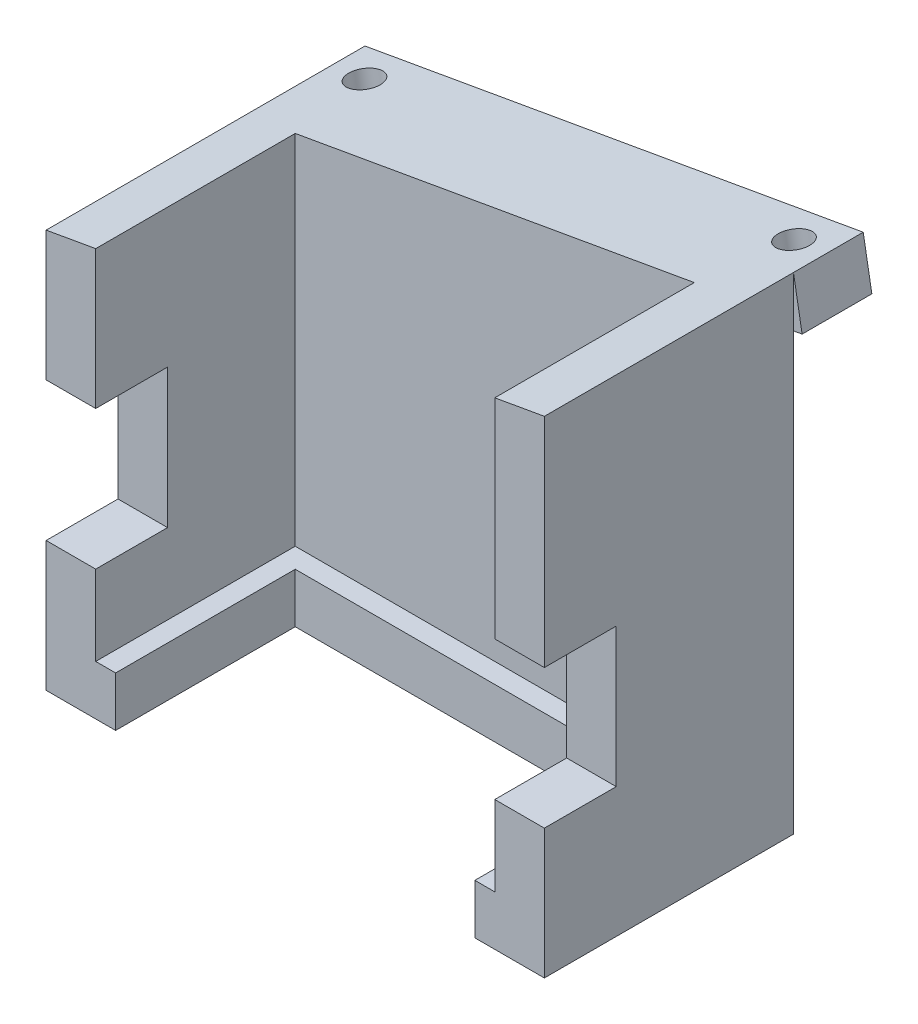
ISO-10303-21;
HEADER;
FILE_DESCRIPTION(('STEP AP214'),'2;1');
FILE_NAME('part.step','',(''),(''),'','','');
FILE_SCHEMA(('AUTOMOTIVE_DESIGN { 1 0 10303 214 1 1 1 1 }'));
ENDSEC;
DATA;
#1=APPLICATION_CONTEXT('core data for automotive mechanical design processes');
#2=APPLICATION_PROTOCOL_DEFINITION('international standard','automotive_design',2000,#1);
#3=PRODUCT_CONTEXT('',#1,'mechanical');
#4=PRODUCT('Part','Part','',(#3));
#5=PRODUCT_RELATED_PRODUCT_CATEGORY('part','',(#4));
#6=PRODUCT_DEFINITION_FORMATION('','',#4);
#7=PRODUCT_DEFINITION_CONTEXT('part definition',#1,'design');
#8=PRODUCT_DEFINITION('design','',#6,#7);
#9=PRODUCT_DEFINITION_SHAPE('','',#8);
#10=(LENGTH_UNIT() NAMED_UNIT(*) SI_UNIT(.MILLI.,.METRE.));
#11=(NAMED_UNIT(*) PLANE_ANGLE_UNIT() SI_UNIT($,.RADIAN.));
#12=(NAMED_UNIT(*) SI_UNIT($,.STERADIAN.) SOLID_ANGLE_UNIT());
#13=UNCERTAINTY_MEASURE_WITH_UNIT(LENGTH_MEASURE(1.E-05),#10,'distance_accuracy_value','');
#14=(GEOMETRIC_REPRESENTATION_CONTEXT(3) GLOBAL_UNCERTAINTY_ASSIGNED_CONTEXT((#13)) GLOBAL_UNIT_ASSIGNED_CONTEXT((#10,
#11,#12)) REPRESENTATION_CONTEXT('',''));
#15=CARTESIAN_POINT('',(0.,0.,0.));
#16=DIRECTION('',(0.,0.,1.));
#17=DIRECTION('',(1.,0.,0.));
#18=AXIS2_PLACEMENT_3D('',#15,#16,#17);
#19=CARTESIAN_POINT('',(-25.01,13.0254840761523,0.));
#20=DIRECTION('',(0.,0.,1.));
#21=DIRECTION('',(1.,0.,0.));
#22=AXIS2_PLACEMENT_3D('',#19,#20,#21);
#23=PLANE('',#22);
#24=DIRECTION('',(1.,0.,0.));
#25=VECTOR('',#24,1.);
#26=CARTESIAN_POINT('',(-25.01,13.0254840761523,0.));
#27=LINE('',#26,#25);
#28=CARTESIAN_POINT('',(-25.,13.0254840761523,0.));
#29=VERTEX_POINT('',#28);
#30=CARTESIAN_POINT('',(-20.025,13.0254840761523,0.));
#31=VERTEX_POINT('',#30);
#32=EDGE_CURVE('E47',#29,#31,#27,.T.);
#33=ORIENTED_EDGE('',*,*,#32,.F.);
#34=DIRECTION('',(0.,-1.,0.));
#35=VECTOR('',#34,1.);
#36=CARTESIAN_POINT('',(-25.,5.,0.));
#37=LINE('',#36,#35);
#38=CARTESIAN_POINT('',(-25.,0.,0.));
#39=VERTEX_POINT('',#38);
#40=EDGE_CURVE('E370',#29,#39,#37,.T.);
#41=ORIENTED_EDGE('',*,*,#40,.T.);
#42=DIRECTION('',(-1.,0.,0.));
#43=VECTOR('',#42,1.);
#44=CARTESIAN_POINT('',(0.,0.,0.));
#45=LINE('',#44,#43);
#46=CARTESIAN_POINT('',(-18.025,0.,0.));
#47=VERTEX_POINT('',#46);
#48=EDGE_CURVE('E228',#47,#39,#45,.T.);
#49=ORIENTED_EDGE('',*,*,#48,.F.);
#50=DIRECTION('',(0.,-1.,0.));
#51=VECTOR('',#50,1.);
#52=CARTESIAN_POINT('',(-18.025,5.,0.));
#53=LINE('',#52,#51);
#54=CARTESIAN_POINT('',(-18.025,5.,0.));
#55=VERTEX_POINT('',#54);
#56=EDGE_CURVE('E353',#55,#47,#53,.T.);
#57=ORIENTED_EDGE('',*,*,#56,.F.);
#58=DIRECTION('',(-1.,0.,0.));
#59=VECTOR('',#58,1.);
#60=CARTESIAN_POINT('',(0.,5.,0.));
#61=LINE('',#60,#59);
#62=CARTESIAN_POINT('',(-20.025,5.,0.));
#63=VERTEX_POINT('',#62);
#64=EDGE_CURVE('E355',#55,#63,#61,.T.);
#65=ORIENTED_EDGE('',*,*,#64,.T.);
#66=DIRECTION('',(0.,-1.,0.));
#67=VECTOR('',#66,1.);
#68=CARTESIAN_POINT('',(-20.025,110.710678118655,0.));
#69=LINE('',#68,#67);
#70=EDGE_CURVE('E325',#31,#63,#69,.T.);
#71=ORIENTED_EDGE('',*,*,#70,.F.);
#72=EDGE_LOOP('',(#33,#41,#49,#57,#65,#71));
#73=FACE_BOUND('',#72,.T.);
#74=ADVANCED_FACE('F37',(#73),#23,.T.);
#75=CARTESIAN_POINT('',(-25.01,13.0254840761523,-7.2127376350945));
#76=DIRECTION('',(0.,1.,0.));
#77=DIRECTION('',(0.,0.,1.));
#78=AXIS2_PLACEMENT_3D('',#75,#76,#77);
#79=PLANE('',#78);
#80=DIRECTION('',(1.,0.,0.));
#81=VECTOR('',#80,1.);
#82=CARTESIAN_POINT('',(-25.01,13.0254840761523,-7.2127376350945));
#83=LINE('',#82,#81);
#84=CARTESIAN_POINT('',(-25.,13.0254840761523,-7.2127376350945));
#85=VERTEX_POINT('',#84);
#86=CARTESIAN_POINT('',(-20.025,13.0254840761523,-7.2127376350945));
#87=VERTEX_POINT('',#86);
#88=EDGE_CURVE('E315',#85,#87,#83,.T.);
#89=ORIENTED_EDGE('',*,*,#88,.F.);
#90=DIRECTION('',(0.,0.,1.));
#91=VECTOR('',#90,1.);
#92=CARTESIAN_POINT('',(-25.,13.0254840761523,-25.));
#93=LINE('',#92,#91);
#94=EDGE_CURVE('E367',#85,#29,#93,.T.);
#95=ORIENTED_EDGE('',*,*,#94,.T.);
#96=ORIENTED_EDGE('',*,*,#32,.T.);
#97=DIRECTION('',(0.,0.,1.));
#98=VECTOR('',#97,1.);
#99=CARTESIAN_POINT('',(-20.025,13.0254840761523,20.025));
#100=LINE('',#99,#98);
#101=EDGE_CURVE('E327',#87,#31,#100,.T.);
#102=ORIENTED_EDGE('',*,*,#101,.F.);
#103=EDGE_LOOP('',(#89,#95,#96,#102));
#104=FACE_BOUND('',#103,.T.);
#105=ADVANCED_FACE('F440',(#104),#79,.T.);
#106=CARTESIAN_POINT('',(-25.01,26.9805634136178,-7.2127376350945));
#107=DIRECTION('',(0.,0.,1.));
#108=DIRECTION('',(1.,0.,0.));
#109=AXIS2_PLACEMENT_3D('',#106,#107,#108);
#110=PLANE('',#109);
#111=DIRECTION('',(1.,0.,0.));
#112=VECTOR('',#111,1.);
#113=CARTESIAN_POINT('',(-25.01,26.9805634136178,-7.2127376350945));
#114=LINE('',#113,#112);
#115=CARTESIAN_POINT('',(-25.,26.9805634136178,-7.2127376350945));
#116=VERTEX_POINT('',#115);
#117=CARTESIAN_POINT('',(-20.025,26.9805634136178,-7.2127376350945));
#118=VERTEX_POINT('',#117);
#119=EDGE_CURVE('E318',#116,#118,#114,.T.);
#120=ORIENTED_EDGE('',*,*,#119,.F.);
#121=DIRECTION('',(0.,-1.,0.));
#122=VECTOR('',#121,1.);
#123=CARTESIAN_POINT('',(-25.,5.,-7.2127376350945));
#124=LINE('',#123,#122);
#125=EDGE_CURVE('E364',#116,#85,#124,.T.);
#126=ORIENTED_EDGE('',*,*,#125,.T.);
#127=ORIENTED_EDGE('',*,*,#88,.T.);
#128=DIRECTION('',(0.,-1.,0.));
#129=VECTOR('',#128,1.);
#130=CARTESIAN_POINT('',(-20.025,110.710678118655,-7.2127376350945));
#131=LINE('',#130,#129);
#132=EDGE_CURVE('E330',#118,#87,#131,.T.);
#133=ORIENTED_EDGE('',*,*,#132,.F.);
#134=EDGE_LOOP('',(#120,#126,#127,#133));
#135=FACE_BOUND('',#134,.T.);
#136=ADVANCED_FACE('F446',(#135),#110,.T.);
#137=CARTESIAN_POINT('',(-25.01,51.2843532710014,0.));
#138=DIRECTION('',(0.,0.,1.));
#139=DIRECTION('',(1.,0.,0.));
#140=AXIS2_PLACEMENT_3D('',#137,#138,#139);
#141=PLANE('',#140);
#142=DIRECTION('',(0.984807749763281,0.17364819609251,0.));
#143=VECTOR('',#142,1.);
#144=CARTESIAN_POINT('',(-7.59424596992729,43.0691043908606,0.));
#145=LINE('',#144,#143);
#146=CARTESIAN_POINT('',(-25.,40.,0.));
#147=VERTEX_POINT('',#146);
#148=CARTESIAN_POINT('',(-20.025,40.877226825,0.));
#149=VERTEX_POINT('',#148);
#150=EDGE_CURVE('E324',#147,#149,#145,.T.);
#151=ORIENTED_EDGE('',*,*,#150,.F.);
#152=DIRECTION('',(0.,-1.,0.));
#153=VECTOR('',#152,1.);
#154=CARTESIAN_POINT('',(-25.,5.,0.));
#155=LINE('',#154,#153);
#156=CARTESIAN_POINT('',(-25.,26.9805634136178,0.));
#157=VERTEX_POINT('',#156);
#158=EDGE_CURVE('E358',#147,#157,#155,.T.);
#159=ORIENTED_EDGE('',*,*,#158,.T.);
#160=DIRECTION('',(1.,0.,0.));
#161=VECTOR('',#160,1.);
#162=CARTESIAN_POINT('',(-25.01,26.9805634136178,0.));
#163=LINE('',#162,#161);
#164=CARTESIAN_POINT('',(-20.025,26.9805634136178,0.));
#165=VERTEX_POINT('',#164);
#166=EDGE_CURVE('E304',#157,#165,#163,.T.);
#167=ORIENTED_EDGE('',*,*,#166,.T.);
#168=DIRECTION('',(0.,-1.,0.));
#169=VECTOR('',#168,1.);
#170=CARTESIAN_POINT('',(-20.025,110.710678118655,0.));
#171=LINE('',#170,#169);
#172=EDGE_CURVE('E336',#149,#165,#171,.T.);
#173=ORIENTED_EDGE('',*,*,#172,.F.);
#174=EDGE_LOOP('',(#151,#159,#167,#173));
#175=FACE_BOUND('',#174,.T.);
#176=ADVANCED_FACE('F547',(#175),#141,.T.);
#177=CARTESIAN_POINT('',(-25.01,26.9805634136178,0.));
#178=DIRECTION('',(0.,-1.,0.));
#179=DIRECTION('',(0.,0.,-1.));
#180=AXIS2_PLACEMENT_3D('',#177,#178,#179);
#181=PLANE('',#180);
#182=ORIENTED_EDGE('',*,*,#166,.F.);
#183=DIRECTION('',(0.,0.,-1.));
#184=VECTOR('',#183,1.);
#185=CARTESIAN_POINT('',(-25.,26.9805634136178,-25.));
#186=LINE('',#185,#184);
#187=EDGE_CURVE('E361',#157,#116,#186,.T.);
#188=ORIENTED_EDGE('',*,*,#187,.T.);
#189=ORIENTED_EDGE('',*,*,#119,.T.);
#190=DIRECTION('',(0.,0.,-1.));
#191=VECTOR('',#190,1.);
#192=CARTESIAN_POINT('',(-20.025,26.9805634136178,20.025));
#193=LINE('',#192,#191);
#194=EDGE_CURVE('E333',#165,#118,#193,.T.);
#195=ORIENTED_EDGE('',*,*,#194,.F.);
#196=EDGE_LOOP('',(#182,#188,#189,#195));
#197=FACE_BOUND('',#196,.T.);
#198=ADVANCED_FACE('F447',(#197),#181,.T.);
#199=CARTESIAN_POINT('',(25.,0.,0.));
#200=VERTEX_POINT('',#199);
#201=CARTESIAN_POINT('',(18.025,0.,0.));
#202=VERTEX_POINT('',#201);
#203=EDGE_CURVE('E211',#200,#202,#45,.T.);
#204=ORIENTED_EDGE('',*,*,#203,.F.);
#205=DIRECTION('',(0.,1.,0.));
#206=VECTOR('',#205,1.);
#207=CARTESIAN_POINT('',(25.,5.,0.));
#208=LINE('',#207,#206);
#209=CARTESIAN_POINT('',(25.,13.0254840761523,0.));
#210=VERTEX_POINT('',#209);
#211=EDGE_CURVE('E224',#200,#210,#208,.T.);
#212=ORIENTED_EDGE('',*,*,#211,.T.);
#213=CARTESIAN_POINT('',(20.025,13.0254840761523,0.));
#214=VERTEX_POINT('',#213);
#215=EDGE_CURVE('E11',#214,#210,#27,.T.);
#216=ORIENTED_EDGE('',*,*,#215,.F.);
#217=DIRECTION('',(0.,1.,0.));
#218=VECTOR('',#217,1.);
#219=CARTESIAN_POINT('',(20.025,110.710678118655,0.));
#220=LINE('',#219,#218);
#221=CARTESIAN_POINT('',(20.025,5.,0.));
#222=VERTEX_POINT('',#221);
#223=EDGE_CURVE('E338',#222,#214,#220,.T.);
#224=ORIENTED_EDGE('',*,*,#223,.F.);
#225=CARTESIAN_POINT('',(18.025,5.,0.));
#226=VERTEX_POINT('',#225);
#227=EDGE_CURVE('E229',#222,#226,#61,.T.);
#228=ORIENTED_EDGE('',*,*,#227,.T.);
#229=DIRECTION('',(0.,1.,0.));
#230=VECTOR('',#229,1.);
#231=CARTESIAN_POINT('',(18.025,5.,0.));
#232=LINE('',#231,#230);
#233=EDGE_CURVE('E227',#202,#226,#232,.T.);
#234=ORIENTED_EDGE('',*,*,#233,.F.);
#235=EDGE_LOOP('',(#204,#212,#216,#224,#228,#234));
#236=FACE_BOUND('',#235,.T.);
#237=ADVANCED_FACE('F223',(#236),#23,.T.);
#238=ORIENTED_EDGE('',*,*,#215,.T.);
#239=DIRECTION('',(0.,0.,-1.));
#240=VECTOR('',#239,1.);
#241=CARTESIAN_POINT('',(25.,13.0254840761523,-25.));
#242=LINE('',#241,#240);
#243=CARTESIAN_POINT('',(25.,13.0254840761523,-7.2127376350945));
#244=VERTEX_POINT('',#243);
#245=EDGE_CURVE('E235',#210,#244,#242,.T.);
#246=ORIENTED_EDGE('',*,*,#245,.T.);
#247=CARTESIAN_POINT('',(20.025,13.0254840761523,-7.2127376350945));
#248=VERTEX_POINT('',#247);
#249=EDGE_CURVE('E313',#248,#244,#83,.T.);
#250=ORIENTED_EDGE('',*,*,#249,.F.);
#251=DIRECTION('',(0.,0.,-1.));
#252=VECTOR('',#251,1.);
#253=CARTESIAN_POINT('',(20.025,13.0254840761523,20.025));
#254=LINE('',#253,#252);
#255=EDGE_CURVE('E341',#214,#248,#254,.T.);
#256=ORIENTED_EDGE('',*,*,#255,.F.);
#257=EDGE_LOOP('',(#238,#246,#250,#256));
#258=FACE_BOUND('',#257,.T.);
#259=ADVANCED_FACE('F437',(#258),#79,.T.);
#260=ORIENTED_EDGE('',*,*,#249,.T.);
#261=DIRECTION('',(0.,1.,0.));
#262=VECTOR('',#261,1.);
#263=CARTESIAN_POINT('',(25.,5.,-7.2127376350945));
#264=LINE('',#263,#262);
#265=CARTESIAN_POINT('',(25.,26.9805634136178,-7.2127376350945));
#266=VERTEX_POINT('',#265);
#267=EDGE_CURVE('E237',#244,#266,#264,.T.);
#268=ORIENTED_EDGE('',*,*,#267,.T.);
#269=CARTESIAN_POINT('',(20.025,26.9805634136178,-7.2127376350945));
#270=VERTEX_POINT('',#269);
#271=EDGE_CURVE('E316',#270,#266,#114,.T.);
#272=ORIENTED_EDGE('',*,*,#271,.F.);
#273=DIRECTION('',(0.,1.,0.));
#274=VECTOR('',#273,1.);
#275=CARTESIAN_POINT('',(20.025,110.710678118655,-7.2127376350945));
#276=LINE('',#275,#274);
#277=EDGE_CURVE('E344',#248,#270,#276,.T.);
#278=ORIENTED_EDGE('',*,*,#277,.F.);
#279=EDGE_LOOP('',(#260,#268,#272,#278));
#280=FACE_BOUND('',#279,.T.);
#281=ADVANCED_FACE('F381',(#280),#110,.T.);
#282=CARTESIAN_POINT('',(20.025,26.9805634136178,0.));
#283=VERTEX_POINT('',#282);
#284=CARTESIAN_POINT('',(25.,26.9805634136178,0.));
#285=VERTEX_POINT('',#284);
#286=EDGE_CURVE('E319',#283,#285,#163,.T.);
#287=ORIENTED_EDGE('',*,*,#286,.T.);
#288=DIRECTION('',(0.,1.,0.));
#289=VECTOR('',#288,1.);
#290=CARTESIAN_POINT('',(25.,5.,0.));
#291=LINE('',#290,#289);
#292=CARTESIAN_POINT('',(25.,48.81635,0.));
#293=VERTEX_POINT('',#292);
#294=EDGE_CURVE('E373',#285,#293,#291,.T.);
#295=ORIENTED_EDGE('',*,*,#294,.T.);
#296=CARTESIAN_POINT('',(20.025,47.939123175,0.));
#297=VERTEX_POINT('',#296);
#298=EDGE_CURVE('E321',#297,#293,#145,.T.);
#299=ORIENTED_EDGE('',*,*,#298,.F.);
#300=DIRECTION('',(0.,1.,0.));
#301=VECTOR('',#300,1.);
#302=CARTESIAN_POINT('',(20.025,110.710678118655,0.));
#303=LINE('',#302,#301);
#304=EDGE_CURVE('E350',#283,#297,#303,.T.);
#305=ORIENTED_EDGE('',*,*,#304,.F.);
#306=EDGE_LOOP('',(#287,#295,#299,#305));
#307=FACE_BOUND('',#306,.T.);
#308=ADVANCED_FACE('F389',(#307),#141,.T.);
#309=ORIENTED_EDGE('',*,*,#271,.T.);
#310=DIRECTION('',(0.,0.,1.));
#311=VECTOR('',#310,1.);
#312=CARTESIAN_POINT('',(25.,26.9805634136178,-25.));
#313=LINE('',#312,#311);
#314=EDGE_CURVE('E376',#266,#285,#313,.T.);
#315=ORIENTED_EDGE('',*,*,#314,.T.);
#316=ORIENTED_EDGE('',*,*,#286,.F.);
#317=DIRECTION('',(0.,0.,1.));
#318=VECTOR('',#317,1.);
#319=CARTESIAN_POINT('',(20.025,26.9805634136178,20.025));
#320=LINE('',#319,#318);
#321=EDGE_CURVE('E347',#270,#283,#320,.T.);
#322=ORIENTED_EDGE('',*,*,#321,.F.);
#323=EDGE_LOOP('',(#309,#315,#316,#322));
#324=FACE_BOUND('',#323,.T.);
#325=ADVANCED_FACE('F384',(#324),#181,.T.);
#326=CARTESIAN_POINT('',(-6.72600498946473,38.1450656420443,0.));
#327=DIRECTION('',(-0.17364819609251,0.984807749763281,0.));
#328=DIRECTION('',(-0.984807749763281,-0.17364819609251,0.));
#329=AXIS2_PLACEMENT_3D('',#326,#327,#328);
#330=PLANE('',#329);
#331=CARTESIAN_POINT('',(-20.684931895366,35.6837299375074,-28.5));
#332=DIRECTION('',(-0.17364819609251,0.984807749763281,0.));
#333=DIRECTION('',(0.984807749763281,0.17364819609251,0.));
#334=AXIS2_PLACEMENT_3D('',#331,#332,#333);
#335=CIRCLE('',#334,1.60000000000001);
#336=CARTESIAN_POINT('',(-19.1092394957447,35.9615670512554,-28.5));
#337=VERTEX_POINT('',#336);
#338=EDGE_CURVE('E301',#337,#337,#335,.T.);
#339=ORIENTED_EDGE('',*,*,#338,.T.);
#340=EDGE_LOOP('',(#339));
#341=FACE_BOUND('',#340,.T.);
#342=CARTESIAN_POINT('',(22.421413856291,43.2845425648598,-28.5));
#343=DIRECTION('',(-0.17364819609251,0.984807749763281,0.));
#344=DIRECTION('',(-0.984807749763281,-0.17364819609251,0.));
#345=AXIS2_PLACEMENT_3D('',#342,#343,#344);
#346=CIRCLE('',#345,1.6);
#347=CARTESIAN_POINT('',(20.8457214566698,43.0067054511118,-28.5));
#348=VERTEX_POINT('',#347);
#349=EDGE_CURVE('E308',#348,#348,#346,.T.);
#350=ORIENTED_EDGE('',*,*,#349,.T.);
#351=EDGE_LOOP('',(#350));
#352=FACE_BOUND('',#351,.T.);
#353=DIRECTION('',(0.984807749763281,0.17364819609251,0.));
#354=VECTOR('',#353,1.);
#355=CARTESIAN_POINT('',(-24.1317590195375,35.0759612511836,-25.));
#356=LINE('',#355,#354);
#357=CARTESIAN_POINT('',(-24.1317590195375,35.0759612511836,-25.));
#358=VERTEX_POINT('',#357);
#359=CARTESIAN_POINT('',(25.,43.7392169238216,-25.));
#360=VERTEX_POINT('',#359);
#361=EDGE_CURVE('E298',#358,#360,#356,.T.);
#362=ORIENTED_EDGE('',*,*,#361,.F.);
#363=DIRECTION('',(0.,0.,1.));
#364=VECTOR('',#363,1.);
#365=CARTESIAN_POINT('',(-24.1317590195375,35.0759612511836,-25.));
#366=LINE('',#365,#364);
#367=CARTESIAN_POINT('',(-24.1317590195375,35.0759612511836,-32.));
#368=VERTEX_POINT('',#367);
#369=EDGE_CURVE('E290',#368,#358,#366,.T.);
#370=ORIENTED_EDGE('',*,*,#369,.F.);
#371=DIRECTION('',(-0.984807749763281,-0.17364819609251,0.));
#372=VECTOR('',#371,1.);
#373=CARTESIAN_POINT('',(-24.1317590195375,35.0759612511836,-32.));
#374=LINE('',#373,#372);
#375=CARTESIAN_POINT('',(25.8682409804625,43.8923112511836,-32.));
#376=VERTEX_POINT('',#375);
#377=EDGE_CURVE('E292',#376,#368,#374,.T.);
#378=ORIENTED_EDGE('',*,*,#377,.F.);
#379=DIRECTION('',(0.,0.,-1.));
#380=VECTOR('',#379,1.);
#381=CARTESIAN_POINT('',(25.8682409804625,43.8923112511836,-25.));
#382=LINE('',#381,#380);
#383=CARTESIAN_POINT('',(25.8682409804625,43.8923112511836,-25.));
#384=VERTEX_POINT('',#383);
#385=EDGE_CURVE('E295',#384,#376,#382,.T.);
#386=ORIENTED_EDGE('',*,*,#385,.F.);
#387=EDGE_CURVE('E81',#360,#384,#356,.T.);
#388=ORIENTED_EDGE('',*,*,#387,.F.);
#389=EDGE_LOOP('',(#362,#370,#378,#386,#388));
#390=FACE_BOUND('',#389,.T.);
#391=ADVANCED_FACE('F408',(#341,#352,#390),#330,.F.);
#392=CARTESIAN_POINT('',(-24.1317590195375,35.0759612511836,-25.));
#393=DIRECTION('',(0.,0.,1.));
#394=DIRECTION('',(1.,0.,0.));
#395=AXIS2_PLACEMENT_3D('',#392,#393,#394);
#396=PLANE('',#395);
#397=DIRECTION('',(-0.17364819609251,0.984807749763281,0.));
#398=VECTOR('',#397,1.);
#399=CARTESIAN_POINT('',(25.8682409804625,43.8923112511836,-25.));
#400=LINE('',#399,#398);
#401=CARTESIAN_POINT('',(25.,48.81635,-25.));
#402=VERTEX_POINT('',#401);
#403=EDGE_CURVE('E293',#384,#402,#400,.T.);
#404=ORIENTED_EDGE('',*,*,#403,.T.);
#405=DIRECTION('',(0.,-1.,0.));
#406=VECTOR('',#405,1.);
#407=CARTESIAN_POINT('',(25.,5.,-25.));
#408=LINE('',#407,#406);
#409=EDGE_CURVE('E323',#402,#360,#408,.T.);
#410=ORIENTED_EDGE('',*,*,#409,.T.);
#411=ORIENTED_EDGE('',*,*,#387,.T.);
#412=EDGE_LOOP('',(#404,#410,#411));
#413=FACE_BOUND('',#412,.T.);
#414=ADVANCED_FACE('F454',(#413),#396,.T.);
#415=CARTESIAN_POINT('',(25.,5.,-25.));
#416=DIRECTION('',(0.,0.,1.));
#417=DIRECTION('',(1.,0.,0.));
#418=AXIS2_PLACEMENT_3D('',#415,#416,#417);
#419=PLANE('',#418);
#420=DIRECTION('',(-0.17364819609251,0.984807749763281,0.));
#421=VECTOR('',#420,1.);
#422=CARTESIAN_POINT('',(-24.1317590195375,35.0759612511836,-25.));
#423=LINE('',#422,#421);
#424=CARTESIAN_POINT('',(-25.,40.,-25.));
#425=VERTEX_POINT('',#424);
#426=EDGE_CURVE('E89',#358,#425,#423,.T.);
#427=ORIENTED_EDGE('',*,*,#426,.F.);
#428=ORIENTED_EDGE('',*,*,#361,.T.);
#429=CARTESIAN_POINT('',(25.,0.,-25.));
#430=VERTEX_POINT('',#429);
#431=EDGE_CURVE('E411',#360,#430,#408,.T.);
#432=ORIENTED_EDGE('',*,*,#431,.T.);
#433=DIRECTION('',(-1.,0.,0.));
#434=VECTOR('',#433,1.);
#435=CARTESIAN_POINT('',(25.,0.,-25.));
#436=LINE('',#435,#434);
#437=CARTESIAN_POINT('',(-25.,0.,-25.));
#438=VERTEX_POINT('',#437);
#439=EDGE_CURVE('E214',#430,#438,#436,.T.);
#440=ORIENTED_EDGE('',*,*,#439,.T.);
#441=DIRECTION('',(0.,-1.,0.));
#442=VECTOR('',#441,1.);
#443=CARTESIAN_POINT('',(-25.,5.,-25.));
#444=LINE('',#443,#442);
#445=EDGE_CURVE('E412',#425,#438,#444,.T.);
#446=ORIENTED_EDGE('',*,*,#445,.F.);
#447=EDGE_LOOP('',(#427,#428,#432,#440,#446));
#448=FACE_BOUND('',#447,.T.);
#449=ADVANCED_FACE('F410',(#448),#419,.F.);
#450=CARTESIAN_POINT('',(18.025,5.,-18.025));
#451=DIRECTION('',(0.,0.,1.));
#452=DIRECTION('',(1.,0.,0.));
#453=AXIS2_PLACEMENT_3D('',#450,#451,#452);
#454=PLANE('',#453);
#455=DIRECTION('',(-1.,0.,0.));
#456=VECTOR('',#455,1.);
#457=CARTESIAN_POINT('',(18.025,0.,-18.025));
#458=LINE('',#457,#456);
#459=CARTESIAN_POINT('',(18.025,0.,-18.025));
#460=VERTEX_POINT('',#459);
#461=CARTESIAN_POINT('',(-18.025,0.,-18.025));
#462=VERTEX_POINT('',#461);
#463=EDGE_CURVE('E249',#460,#462,#458,.T.);
#464=ORIENTED_EDGE('',*,*,#463,.F.);
#465=DIRECTION('',(0.,-1.,0.));
#466=VECTOR('',#465,1.);
#467=CARTESIAN_POINT('',(18.025,5.,-18.025));
#468=LINE('',#467,#466);
#469=CARTESIAN_POINT('',(18.025,5.,-18.025));
#470=VERTEX_POINT('',#469);
#471=EDGE_CURVE('E242',#470,#460,#468,.T.);
#472=ORIENTED_EDGE('',*,*,#471,.F.);
#473=DIRECTION('',(-1.,0.,0.));
#474=VECTOR('',#473,1.);
#475=CARTESIAN_POINT('',(18.025,5.,-18.025));
#476=LINE('',#475,#474);
#477=CARTESIAN_POINT('',(-18.025,5.,-18.025));
#478=VERTEX_POINT('',#477);
#479=EDGE_CURVE('E246',#470,#478,#476,.T.);
#480=ORIENTED_EDGE('',*,*,#479,.T.);
#481=DIRECTION('',(0.,-1.,0.));
#482=VECTOR('',#481,1.);
#483=CARTESIAN_POINT('',(-18.025,5.,-18.025));
#484=LINE('',#483,#482);
#485=EDGE_CURVE('E420',#478,#462,#484,.T.);
#486=ORIENTED_EDGE('',*,*,#485,.T.);
#487=EDGE_LOOP('',(#464,#472,#480,#486));
#488=FACE_BOUND('',#487,.T.);
#489=ADVANCED_FACE('F514',(#488),#454,.T.);
#490=CARTESIAN_POINT('',(0.,5.,0.));
#491=DIRECTION('',(0.,-1.,0.));
#492=DIRECTION('',(0.,0.,-1.));
#493=AXIS2_PLACEMENT_3D('',#490,#491,#492);
#494=PLANE('',#493);
#495=ORIENTED_EDGE('',*,*,#227,.F.);
#496=DIRECTION('',(0.,0.,-1.));
#497=VECTOR('',#496,1.);
#498=CARTESIAN_POINT('',(20.025,5.,0.));
#499=LINE('',#498,#497);
#500=CARTESIAN_POINT('',(20.025,5.,-20.025));
#501=VERTEX_POINT('',#500);
#502=EDGE_CURVE('E256',#222,#501,#499,.T.);
#503=ORIENTED_EDGE('',*,*,#502,.T.);
#504=DIRECTION('',(-1.,0.,0.));
#505=VECTOR('',#504,1.);
#506=CARTESIAN_POINT('',(0.,5.,-20.025));
#507=LINE('',#506,#505);
#508=CARTESIAN_POINT('',(-20.025,5.,-20.025));
#509=VERTEX_POINT('',#508);
#510=EDGE_CURVE('E255',#501,#509,#507,.T.);
#511=ORIENTED_EDGE('',*,*,#510,.T.);
#512=DIRECTION('',(0.,0.,1.));
#513=VECTOR('',#512,1.);
#514=CARTESIAN_POINT('',(-20.025,5.,0.));
#515=LINE('',#514,#513);
#516=EDGE_CURVE('E258',#509,#63,#515,.T.);
#517=ORIENTED_EDGE('',*,*,#516,.T.);
#518=ORIENTED_EDGE('',*,*,#64,.F.);
#519=DIRECTION('',(0.,0.,1.));
#520=VECTOR('',#519,1.);
#521=CARTESIAN_POINT('',(-18.025,5.,-18.025));
#522=LINE('',#521,#520);
#523=EDGE_CURVE('E245',#478,#55,#522,.T.);
#524=ORIENTED_EDGE('',*,*,#523,.F.);
#525=ORIENTED_EDGE('',*,*,#479,.F.);
#526=DIRECTION('',(0.,0.,-1.));
#527=VECTOR('',#526,1.);
#528=CARTESIAN_POINT('',(18.025,5.,-18.025));
#529=LINE('',#528,#527);
#530=EDGE_CURVE('E243',#226,#470,#529,.T.);
#531=ORIENTED_EDGE('',*,*,#530,.F.);
#532=EDGE_LOOP('',(#495,#503,#511,#517,#518,#524,#525,#531));
#533=FACE_BOUND('',#532,.T.);
#534=ADVANCED_FACE('F432',(#533),#494,.F.);
#535=CARTESIAN_POINT('',(-24.1317590195375,35.0759612511836,-25.));
#536=DIRECTION('',(-0.984807749763281,-0.17364819609251,0.));
#537=DIRECTION('',(0.17364819609251,-0.984807749763281,0.));
#538=AXIS2_PLACEMENT_3D('',#535,#536,#537);
#539=PLANE('',#538);
#540=DIRECTION('',(0.,0.,1.));
#541=VECTOR('',#540,1.);
#542=CARTESIAN_POINT('',(-25.,40.,-25.));
#543=LINE('',#542,#541);
#544=CARTESIAN_POINT('',(-25.,40.,-32.));
#545=VERTEX_POINT('',#544);
#546=EDGE_CURVE('E282',#545,#425,#543,.T.);
#547=ORIENTED_EDGE('',*,*,#546,.F.);
#548=DIRECTION('',(-0.17364819609251,0.984807749763281,0.));
#549=VECTOR('',#548,1.);
#550=CARTESIAN_POINT('',(-24.1317590195375,35.0759612511836,-32.));
#551=LINE('',#550,#549);
#552=EDGE_CURVE('E277',#368,#545,#551,.T.);
#553=ORIENTED_EDGE('',*,*,#552,.F.);
#554=ORIENTED_EDGE('',*,*,#369,.T.);
#555=ORIENTED_EDGE('',*,*,#426,.T.);
#556=EDGE_LOOP('',(#547,#553,#554,#555));
#557=FACE_BOUND('',#556,.T.);
#558=ADVANCED_FACE('F405',(#557),#539,.T.);
#559=CARTESIAN_POINT('',(-24.1317590195375,35.0759612511836,-32.));
#560=DIRECTION('',(0.,0.,-1.));
#561=DIRECTION('',(0.,1.,0.));
#562=AXIS2_PLACEMENT_3D('',#559,#560,#561);
#563=PLANE('',#562);
#564=DIRECTION('',(-0.984807749763281,-0.17364819609251,0.));
#565=VECTOR('',#564,1.);
#566=CARTESIAN_POINT('',(-25.,40.,-32.));
#567=LINE('',#566,#565);
#568=CARTESIAN_POINT('',(25.,48.81635,-32.));
#569=VERTEX_POINT('',#568);
#570=EDGE_CURVE('E284',#569,#545,#567,.T.);
#571=ORIENTED_EDGE('',*,*,#570,.F.);
#572=DIRECTION('',(-0.17364819609251,0.984807749763281,0.));
#573=VECTOR('',#572,1.);
#574=CARTESIAN_POINT('',(25.8682409804625,43.8923112511836,-32.));
#575=LINE('',#574,#573);
#576=EDGE_CURVE('E74',#376,#569,#575,.T.);
#577=ORIENTED_EDGE('',*,*,#576,.F.);
#578=ORIENTED_EDGE('',*,*,#377,.T.);
#579=ORIENTED_EDGE('',*,*,#552,.T.);
#580=EDGE_LOOP('',(#571,#577,#578,#579));
#581=FACE_BOUND('',#580,.T.);
#582=ADVANCED_FACE('F403',(#581),#563,.T.);
#583=CARTESIAN_POINT('',(25.8682409804625,43.8923112511836,-25.));
#584=DIRECTION('',(0.984807749763281,0.17364819609251,0.));
#585=DIRECTION('',(-0.17364819609251,0.984807749763281,0.));
#586=AXIS2_PLACEMENT_3D('',#583,#584,#585);
#587=PLANE('',#586);
#588=DIRECTION('',(0.,0.,-1.));
#589=VECTOR('',#588,1.);
#590=CARTESIAN_POINT('',(25.,48.81635,-25.));
#591=LINE('',#590,#589);
#592=EDGE_CURVE('E287',#402,#569,#591,.T.);
#593=ORIENTED_EDGE('',*,*,#592,.F.);
#594=ORIENTED_EDGE('',*,*,#403,.F.);
#595=ORIENTED_EDGE('',*,*,#385,.T.);
#596=ORIENTED_EDGE('',*,*,#576,.T.);
#597=EDGE_LOOP('',(#593,#594,#595,#596));
#598=FACE_BOUND('',#597,.T.);
#599=ADVANCED_FACE('F400',(#598),#587,.T.);
#600=CARTESIAN_POINT('',(25.,5.,-25.));
#601=DIRECTION('',(-1.,0.,0.));
#602=DIRECTION('',(0.,0.,1.));
#603=AXIS2_PLACEMENT_3D('',#600,#601,#602);
#604=PLANE('',#603);
#605=ORIENTED_EDGE('',*,*,#294,.F.);
#606=ORIENTED_EDGE('',*,*,#314,.F.);
#607=ORIENTED_EDGE('',*,*,#267,.F.);
#608=ORIENTED_EDGE('',*,*,#245,.F.);
#609=ORIENTED_EDGE('',*,*,#211,.F.);
#610=DIRECTION('',(0.,0.,-1.));
#611=VECTOR('',#610,1.);
#612=CARTESIAN_POINT('',(25.,0.,-25.));
#613=LINE('',#612,#611);
#614=EDGE_CURVE('E208',#200,#430,#613,.T.);
#615=ORIENTED_EDGE('',*,*,#614,.T.);
#616=ORIENTED_EDGE('',*,*,#431,.F.);
#617=ORIENTED_EDGE('',*,*,#409,.F.);
#618=DIRECTION('',(0.,0.,-1.));
#619=VECTOR('',#618,1.);
#620=CARTESIAN_POINT('',(25.,48.81635,25.));
#621=LINE('',#620,#619);
#622=EDGE_CURVE('E56',#293,#402,#621,.T.);
#623=ORIENTED_EDGE('',*,*,#622,.F.);
#624=EDGE_LOOP('',(#605,#606,#607,#608,#609,#615,#616,#617,#623));
#625=FACE_BOUND('',#624,.T.);
#626=ADVANCED_FACE('F232',(#625),#604,.F.);
#627=CARTESIAN_POINT('',(20.025,110.710678118655,20.025));
#628=DIRECTION('',(-1.,0.,0.));
#629=DIRECTION('',(0.,0.,1.));
#630=AXIS2_PLACEMENT_3D('',#627,#628,#629);
#631=PLANE('',#630);
#632=ORIENTED_EDGE('',*,*,#321,.T.);
#633=ORIENTED_EDGE('',*,*,#304,.T.);
#634=DIRECTION('',(0.,0.,-1.));
#635=VECTOR('',#634,1.);
#636=CARTESIAN_POINT('',(20.025,47.939123175,20.025));
#637=LINE('',#636,#635);
#638=CARTESIAN_POINT('',(20.025,47.939123175,-20.025));
#639=VERTEX_POINT('',#638);
#640=EDGE_CURVE('E41',#297,#639,#637,.T.);
#641=ORIENTED_EDGE('',*,*,#640,.T.);
#642=DIRECTION('',(0.,-1.,0.));
#643=VECTOR('',#642,1.);
#644=CARTESIAN_POINT('',(20.025,110.710678118655,-20.025));
#645=LINE('',#644,#643);
#646=EDGE_CURVE('E261',#639,#501,#645,.T.);
#647=ORIENTED_EDGE('',*,*,#646,.T.);
#648=ORIENTED_EDGE('',*,*,#502,.F.);
#649=ORIENTED_EDGE('',*,*,#223,.T.);
#650=ORIENTED_EDGE('',*,*,#255,.T.);
#651=ORIENTED_EDGE('',*,*,#277,.T.);
#652=EDGE_LOOP('',(#632,#633,#641,#647,#648,#649,#650,#651));
#653=FACE_BOUND('',#652,.T.);
#654=ADVANCED_FACE('F387',(#653),#631,.T.);
#655=CARTESIAN_POINT('',(20.025,110.710678118655,-20.025));
#656=DIRECTION('',(0.,0.,1.));
#657=DIRECTION('',(1.,0.,0.));
#658=AXIS2_PLACEMENT_3D('',#655,#656,#657);
#659=PLANE('',#658);
#660=ORIENTED_EDGE('',*,*,#510,.F.);
#661=ORIENTED_EDGE('',*,*,#646,.F.);
#662=DIRECTION('',(-0.984807749763281,-0.17364819609251,0.));
#663=VECTOR('',#662,1.);
#664=CARTESIAN_POINT('',(31.6066827751661,49.9812865536967,-20.025));
#665=LINE('',#664,#663);
#666=CARTESIAN_POINT('',(-20.025,40.877226825,-20.025));
#667=VERTEX_POINT('',#666);
#668=EDGE_CURVE('E265',#639,#667,#665,.T.);
#669=ORIENTED_EDGE('',*,*,#668,.T.);
#670=DIRECTION('',(0.,-1.,0.));
#671=VECTOR('',#670,1.);
#672=CARTESIAN_POINT('',(-20.025,110.710678118655,-20.025));
#673=LINE('',#672,#671);
#674=EDGE_CURVE('E266',#667,#509,#673,.T.);
#675=ORIENTED_EDGE('',*,*,#674,.T.);
#676=EDGE_LOOP('',(#660,#661,#669,#675));
#677=FACE_BOUND('',#676,.T.);
#678=ADVANCED_FACE('F429',(#677),#659,.T.);
#679=CARTESIAN_POINT('',(-20.025,110.710678118655,20.025));
#680=DIRECTION('',(1.,0.,0.));
#681=DIRECTION('',(0.,0.,-1.));
#682=AXIS2_PLACEMENT_3D('',#679,#680,#681);
#683=PLANE('',#682);
#684=DIRECTION('',(0.,0.,1.));
#685=VECTOR('',#684,1.);
#686=CARTESIAN_POINT('',(-20.025,40.877226825,20.025));
#687=LINE('',#686,#685);
#688=EDGE_CURVE('E267',#667,#149,#687,.T.);
#689=ORIENTED_EDGE('',*,*,#688,.T.);
#690=ORIENTED_EDGE('',*,*,#172,.T.);
#691=ORIENTED_EDGE('',*,*,#194,.T.);
#692=ORIENTED_EDGE('',*,*,#132,.T.);
#693=ORIENTED_EDGE('',*,*,#101,.T.);
#694=ORIENTED_EDGE('',*,*,#70,.T.);
#695=ORIENTED_EDGE('',*,*,#516,.F.);
#696=ORIENTED_EDGE('',*,*,#674,.F.);
#697=EDGE_LOOP('',(#689,#690,#691,#692,#693,#694,#695,#696));
#698=FACE_BOUND('',#697,.T.);
#699=ADVANCED_FACE('F498',(#698),#683,.T.);
#700=CARTESIAN_POINT('',(-25.,5.,-25.));
#701=DIRECTION('',(1.,0.,0.));
#702=DIRECTION('',(0.,0.,-1.));
#703=AXIS2_PLACEMENT_3D('',#700,#701,#702);
#704=PLANE('',#703);
#705=ORIENTED_EDGE('',*,*,#158,.F.);
#706=DIRECTION('',(0.,0.,1.));
#707=VECTOR('',#706,1.);
#708=CARTESIAN_POINT('',(-25.,40.,25.));
#709=LINE('',#708,#707);
#710=EDGE_CURVE('E262',#425,#147,#709,.T.);
#711=ORIENTED_EDGE('',*,*,#710,.F.);
#712=ORIENTED_EDGE('',*,*,#445,.T.);
#713=DIRECTION('',(0.,0.,1.));
#714=VECTOR('',#713,1.);
#715=CARTESIAN_POINT('',(-25.,0.,-25.));
#716=LINE('',#715,#714);
#717=EDGE_CURVE('E219',#438,#39,#716,.T.);
#718=ORIENTED_EDGE('',*,*,#717,.T.);
#719=ORIENTED_EDGE('',*,*,#40,.F.);
#720=ORIENTED_EDGE('',*,*,#94,.F.);
#721=ORIENTED_EDGE('',*,*,#125,.F.);
#722=ORIENTED_EDGE('',*,*,#187,.F.);
#723=EDGE_LOOP('',(#705,#711,#712,#718,#719,#720,#721,#722));
#724=FACE_BOUND('',#723,.T.);
#725=ADVANCED_FACE('F470',(#724),#704,.F.);
#726=CARTESIAN_POINT('',(-20.684931895366,35.6837299375074,-28.5));
#727=DIRECTION('',(-0.17364819609251,0.984807749763281,0.));
#728=DIRECTION('',(-0.984807749763281,-0.17364819609251,0.));
#729=AXIS2_PLACEMENT_3D('',#726,#727,#728);
#730=CYLINDRICAL_SURFACE('',#729,1.60000000000001);
#731=ORIENTED_EDGE('',*,*,#338,.F.);
#732=EDGE_LOOP('',(#731));
#733=FACE_BOUND('',#732,.T.);
#734=CARTESIAN_POINT('',(-21.5531728758285,40.6077686863238,-28.5));
#735=DIRECTION('',(-0.17364819609251,0.984807749763281,0.));
#736=DIRECTION('',(0.984807749763281,0.17364819609251,0.));
#737=AXIS2_PLACEMENT_3D('',#734,#735,#736);
#738=CIRCLE('',#737,1.60000000000001);
#739=CARTESIAN_POINT('',(-19.9774804762073,40.8856058000718,-28.5));
#740=VERTEX_POINT('',#739);
#741=EDGE_CURVE('E305',#740,#740,#738,.T.);
#742=ORIENTED_EDGE('',*,*,#741,.T.);
#743=EDGE_LOOP('',(#742));
#744=FACE_BOUND('',#743,.T.);
#745=ADVANCED_FACE('F467',(#733,#744),#730,.F.);
#746=CARTESIAN_POINT('',(22.421413856291,43.2845425648598,-28.5));
#747=DIRECTION('',(-0.17364819609251,0.984807749763281,0.));
#748=DIRECTION('',(-0.984807749763281,-0.17364819609251,0.));
#749=AXIS2_PLACEMENT_3D('',#746,#747,#748);
#750=CYLINDRICAL_SURFACE('',#749,1.6);
#751=ORIENTED_EDGE('',*,*,#349,.F.);
#752=EDGE_LOOP('',(#751));
#753=FACE_BOUND('',#752,.T.);
#754=CARTESIAN_POINT('',(21.5531728758285,48.2085813136762,-28.5));
#755=DIRECTION('',(-0.17364819609251,0.984807749763281,0.));
#756=DIRECTION('',(-0.984807749763281,-0.17364819609251,0.));
#757=AXIS2_PLACEMENT_3D('',#754,#755,#756);
#758=CIRCLE('',#757,1.6);
#759=CARTESIAN_POINT('',(19.9774804762073,47.9307441999282,-28.5));
#760=VERTEX_POINT('',#759);
#761=EDGE_CURVE('E289',#760,#760,#758,.T.);
#762=ORIENTED_EDGE('',*,*,#761,.T.);
#763=EDGE_LOOP('',(#762));
#764=FACE_BOUND('',#763,.T.);
#765=ADVANCED_FACE('F469',(#753,#764),#750,.F.);
#766=CARTESIAN_POINT('',(-7.59424596992729,43.0691043908606,0.));
#767=DIRECTION('',(-0.17364819609251,0.984807749763281,0.));
#768=DIRECTION('',(-0.984807749763281,-0.17364819609251,0.));
#769=AXIS2_PLACEMENT_3D('',#766,#767,#768);
#770=PLANE('',#769);
#771=ORIENTED_EDGE('',*,*,#761,.F.);
#772=EDGE_LOOP('',(#771));
#773=FACE_BOUND('',#772,.T.);
#774=ORIENTED_EDGE('',*,*,#741,.F.);
#775=EDGE_LOOP('',(#774));
#776=FACE_BOUND('',#775,.T.);
#777=ORIENTED_EDGE('',*,*,#710,.T.);
#778=ORIENTED_EDGE('',*,*,#150,.T.);
#779=ORIENTED_EDGE('',*,*,#688,.F.);
#780=ORIENTED_EDGE('',*,*,#668,.F.);
#781=ORIENTED_EDGE('',*,*,#640,.F.);
#782=ORIENTED_EDGE('',*,*,#298,.T.);
#783=ORIENTED_EDGE('',*,*,#622,.T.);
#784=ORIENTED_EDGE('',*,*,#592,.T.);
#785=ORIENTED_EDGE('',*,*,#570,.T.);
#786=ORIENTED_EDGE('',*,*,#546,.T.);
#787=EDGE_LOOP('',(#777,#778,#779,#780,#781,#782,#783,#784,#785,#786));
#788=FACE_BOUND('',#787,.T.);
#789=ADVANCED_FACE('F39',(#773,#776,#788),#770,.T.);
#790=CARTESIAN_POINT('',(0.,0.,0.));
#791=DIRECTION('',(0.,-1.,0.));
#792=DIRECTION('',(0.,0.,-1.));
#793=AXIS2_PLACEMENT_3D('',#790,#791,#792);
#794=PLANE('',#793);
#795=ORIENTED_EDGE('',*,*,#614,.F.);
#796=ORIENTED_EDGE('',*,*,#203,.T.);
#797=DIRECTION('',(0.,0.,-1.));
#798=VECTOR('',#797,1.);
#799=CARTESIAN_POINT('',(18.025,0.,-18.025));
#800=LINE('',#799,#798);
#801=EDGE_CURVE('E250',#202,#460,#800,.T.);
#802=ORIENTED_EDGE('',*,*,#801,.T.);
#803=ORIENTED_EDGE('',*,*,#463,.T.);
#804=DIRECTION('',(0.,0.,1.));
#805=VECTOR('',#804,1.);
#806=CARTESIAN_POINT('',(-18.025,0.,-18.025));
#807=LINE('',#806,#805);
#808=EDGE_CURVE('E252',#462,#47,#807,.T.);
#809=ORIENTED_EDGE('',*,*,#808,.T.);
#810=ORIENTED_EDGE('',*,*,#48,.T.);
#811=ORIENTED_EDGE('',*,*,#717,.F.);
#812=ORIENTED_EDGE('',*,*,#439,.F.);
#813=EDGE_LOOP('',(#795,#796,#802,#803,#809,#810,#811,#812));
#814=FACE_BOUND('',#813,.T.);
#815=ADVANCED_FACE('F210',(#814),#794,.T.);
#816=CARTESIAN_POINT('',(18.025,5.,-18.025));
#817=DIRECTION('',(-1.,0.,0.));
#818=DIRECTION('',(0.,0.,1.));
#819=AXIS2_PLACEMENT_3D('',#816,#817,#818);
#820=PLANE('',#819);
#821=ORIENTED_EDGE('',*,*,#801,.F.);
#822=ORIENTED_EDGE('',*,*,#233,.T.);
#823=ORIENTED_EDGE('',*,*,#530,.T.);
#824=ORIENTED_EDGE('',*,*,#471,.T.);
#825=EDGE_LOOP('',(#821,#822,#823,#824));
#826=FACE_BOUND('',#825,.T.);
#827=ADVANCED_FACE('F487',(#826),#820,.T.);
#828=CARTESIAN_POINT('',(-18.025,5.,-18.025));
#829=DIRECTION('',(1.,0.,0.));
#830=DIRECTION('',(0.,0.,-1.));
#831=AXIS2_PLACEMENT_3D('',#828,#829,#830);
#832=PLANE('',#831);
#833=ORIENTED_EDGE('',*,*,#523,.T.);
#834=ORIENTED_EDGE('',*,*,#56,.T.);
#835=ORIENTED_EDGE('',*,*,#808,.F.);
#836=ORIENTED_EDGE('',*,*,#485,.F.);
#837=EDGE_LOOP('',(#833,#834,#835,#836));
#838=FACE_BOUND('',#837,.T.);
#839=ADVANCED_FACE('F449',(#838),#832,.T.);
#840=CLOSED_SHELL('',(#74,#105,#136,#176,#198,#237,#259,#281,#308,#325,#391,#414,#449,#489,#534,
#558,#582,#599,#626,#654,#678,#699,#725,#745,#765,#789,#815,#827,#839));
#841=MANIFOLD_SOLID_BREP('B2',#840);
#842=ADVANCED_BREP_SHAPE_REPRESENTATION('',(#18,#841),#14);
#843=SHAPE_DEFINITION_REPRESENTATION(#9,#842);
ENDSEC;
END-ISO-10303-21;
